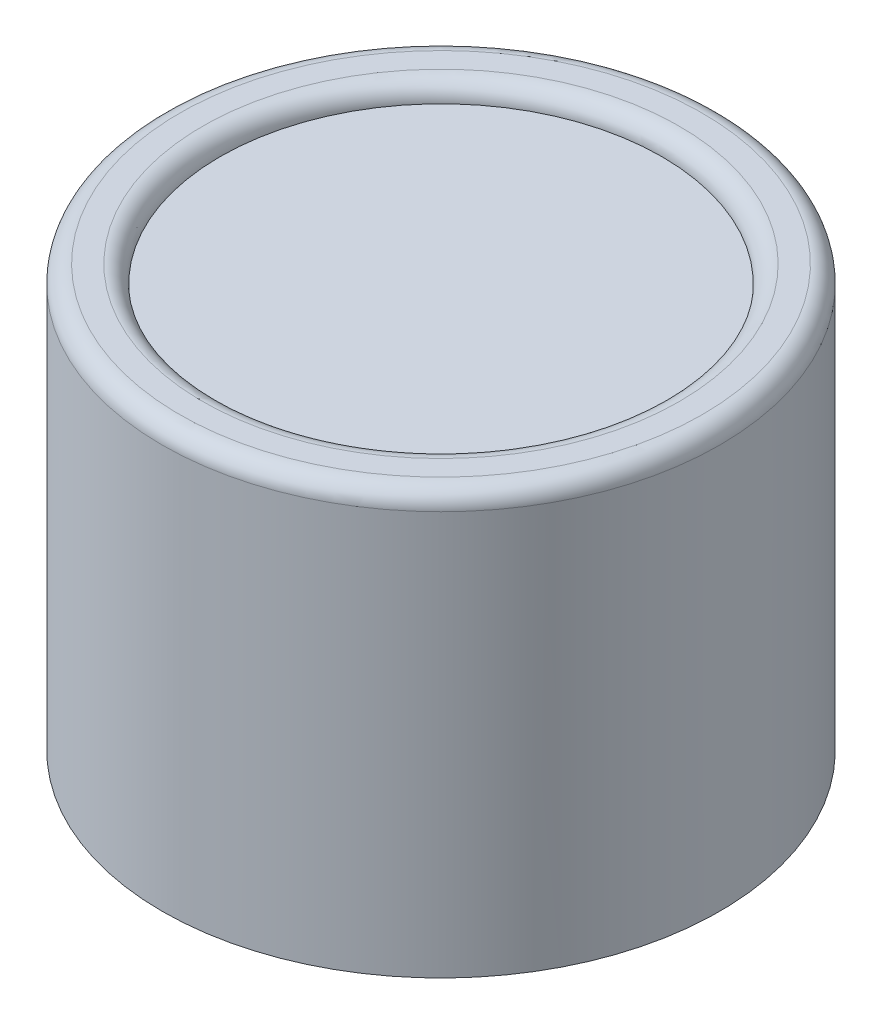
ISO-10303-21;
HEADER;
FILE_DESCRIPTION(('STEP AP214'),'2;1');
FILE_NAME('part.step','',(''),(''),'','','');
FILE_SCHEMA(('AUTOMOTIVE_DESIGN { 1 0 10303 214 1 1 1 1 }'));
ENDSEC;
DATA;
#1=APPLICATION_CONTEXT('core data for automotive mechanical design processes');
#2=APPLICATION_PROTOCOL_DEFINITION('international standard','automotive_design',2000,#1);
#3=PRODUCT_CONTEXT('',#1,'mechanical');
#4=PRODUCT('Part','Part','',(#3));
#5=PRODUCT_RELATED_PRODUCT_CATEGORY('part','',(#4));
#6=PRODUCT_DEFINITION_FORMATION('','',#4);
#7=PRODUCT_DEFINITION_CONTEXT('part definition',#1,'design');
#8=PRODUCT_DEFINITION('design','',#6,#7);
#9=PRODUCT_DEFINITION_SHAPE('','',#8);
#10=(LENGTH_UNIT() NAMED_UNIT(*) SI_UNIT(.MILLI.,.METRE.));
#11=(NAMED_UNIT(*) PLANE_ANGLE_UNIT() SI_UNIT($,.RADIAN.));
#12=(NAMED_UNIT(*) SI_UNIT($,.STERADIAN.) SOLID_ANGLE_UNIT());
#13=UNCERTAINTY_MEASURE_WITH_UNIT(LENGTH_MEASURE(1.E-05),#10,'distance_accuracy_value','');
#14=(GEOMETRIC_REPRESENTATION_CONTEXT(3) GLOBAL_UNCERTAINTY_ASSIGNED_CONTEXT((#13)) GLOBAL_UNIT_ASSIGNED_CONTEXT((#10,
#11,#12)) REPRESENTATION_CONTEXT('',''));
#15=CARTESIAN_POINT('',(0.,0.,0.));
#16=DIRECTION('',(0.,0.,1.));
#17=DIRECTION('',(1.,0.,0.));
#18=AXIS2_PLACEMENT_3D('',#15,#16,#17);
#19=CARTESIAN_POINT('',(-162.96132,0.,-162.96132));
#20=DIRECTION('',(0.,1.,0.));
#21=DIRECTION('',(0.,0.,1.));
#22=AXIS2_PLACEMENT_3D('',#19,#20,#21);
#23=PLANE('',#22);
#24=CARTESIAN_POINT('',(0.,0.,0.));
#25=DIRECTION('',(0.,-1.,0.));
#26=DIRECTION('',(1.,0.,0.));
#27=AXIS2_PLACEMENT_3D('',#24,#25,#26);
#28=CIRCLE('',#27,159.766);
#29=CARTESIAN_POINT('',(159.766,0.,0.));
#30=VERTEX_POINT('',#29);
#31=EDGE_CURVE('E19',#30,#30,#28,.T.);
#32=ORIENTED_EDGE('',*,*,#31,.F.);
#33=EDGE_LOOP('',(#32));
#34=FACE_BOUND('',#33,.T.);
#35=ADVANCED_FACE('F15',(#34),#23,.T.);
#36=CARTESIAN_POINT('',(0.,0.,0.));
#37=DIRECTION('',(0.,-1.,0.));
#38=DIRECTION('',(1.,0.,0.));
#39=AXIS2_PLACEMENT_3D('',#36,#37,#38);
#40=TOROIDAL_SURFACE('',#39,172.466,12.7);
#41=ORIENTED_EDGE('',*,*,#31,.T.);
#42=EDGE_LOOP('',(#41));
#43=FACE_BOUND('',#42,.T.);
#44=CARTESIAN_POINT('',(0.,12.7,0.));
#45=DIRECTION('',(0.,-1.,0.));
#46=DIRECTION('',(1.,0.,0.));
#47=AXIS2_PLACEMENT_3D('',#44,#45,#46);
#48=CIRCLE('',#47,172.466);
#49=CARTESIAN_POINT('',(172.466,12.7,0.));
#50=VERTEX_POINT('',#49);
#51=EDGE_CURVE('E32',#50,#50,#48,.T.);
#52=ORIENTED_EDGE('',*,*,#51,.F.);
#53=EDGE_LOOP('',(#52));
#54=FACE_BOUND('',#53,.T.);
#55=ADVANCED_FACE('F39',(#43,#54),#40,.T.);
#56=CARTESIAN_POINT('',(-192.75552,12.7,-192.75552));
#57=DIRECTION('',(0.,1.,0.));
#58=DIRECTION('',(0.,0.,1.));
#59=AXIS2_PLACEMENT_3D('',#56,#57,#58);
#60=PLANE('',#59);
#61=ORIENTED_EDGE('',*,*,#51,.T.);
#62=EDGE_LOOP('',(#61));
#63=FACE_BOUND('',#62,.T.);
#64=CARTESIAN_POINT('',(0.,12.7,0.));
#65=DIRECTION('',(0.,-1.,0.));
#66=DIRECTION('',(1.,0.,0.));
#67=AXIS2_PLACEMENT_3D('',#64,#65,#66);
#68=CIRCLE('',#67,188.976);
#69=CARTESIAN_POINT('',(188.976,12.7,0.));
#70=VERTEX_POINT('',#69);
#71=EDGE_CURVE('E28',#70,#70,#68,.T.);
#72=ORIENTED_EDGE('',*,*,#71,.F.);
#73=EDGE_LOOP('',(#72));
#74=FACE_BOUND('',#73,.T.);
#75=ADVANCED_FACE('F48',(#63,#74),#60,.T.);
#76=CARTESIAN_POINT('',(205.70952,-292.1,-205.70952));
#77=DIRECTION('',(0.,-1.,0.));
#78=DIRECTION('',(0.,0.,-1.));
#79=AXIS2_PLACEMENT_3D('',#76,#77,#78);
#80=PLANE('',#79);
#81=CARTESIAN_POINT('',(0.,-292.1,0.));
#82=DIRECTION('',(0.,1.,0.));
#83=DIRECTION('',(0.,0.,1.));
#84=AXIS2_PLACEMENT_3D('',#81,#82,#83);
#85=CIRCLE('',#84,201.676);
#86=CARTESIAN_POINT('',(0.,-292.1,201.676));
#87=VERTEX_POINT('',#86);
#88=EDGE_CURVE('E23',#87,#87,#85,.T.);
#89=ORIENTED_EDGE('',*,*,#88,.F.);
#90=EDGE_LOOP('',(#89));
#91=FACE_BOUND('',#90,.T.);
#92=ADVANCED_FACE('F56',(#91),#80,.T.);
#93=CARTESIAN_POINT('',(0.,0.,0.));
#94=DIRECTION('',(0.,-1.,0.));
#95=DIRECTION('',(1.,0.,0.));
#96=AXIS2_PLACEMENT_3D('',#93,#94,#95);
#97=TOROIDAL_SURFACE('',#96,188.976,12.7);
#98=CARTESIAN_POINT('',(0.,0.,0.));
#99=DIRECTION('',(0.,-1.,0.));
#100=DIRECTION('',(1.,0.,0.));
#101=AXIS2_PLACEMENT_3D('',#98,#99,#100);
#102=CIRCLE('',#101,201.676);
#103=CARTESIAN_POINT('',(201.676,0.,0.));
#104=VERTEX_POINT('',#103);
#105=EDGE_CURVE('E10',#104,#104,#102,.T.);
#106=ORIENTED_EDGE('',*,*,#105,.F.);
#107=EDGE_LOOP('',(#106));
#108=FACE_BOUND('',#107,.T.);
#109=ORIENTED_EDGE('',*,*,#71,.T.);
#110=EDGE_LOOP('',(#109));
#111=FACE_BOUND('',#110,.T.);
#112=ADVANCED_FACE('F52',(#108,#111),#97,.T.);
#113=CARTESIAN_POINT('',(0.,-292.1,0.));
#114=DIRECTION('',(0.,1.,0.));
#115=DIRECTION('',(0.,0.,1.));
#116=AXIS2_PLACEMENT_3D('',#113,#114,#115);
#117=CYLINDRICAL_SURFACE('',#116,201.676);
#118=ORIENTED_EDGE('',*,*,#105,.T.);
#119=EDGE_LOOP('',(#118));
#120=FACE_BOUND('',#119,.T.);
#121=ORIENTED_EDGE('',*,*,#88,.T.);
#122=EDGE_LOOP('',(#121));
#123=FACE_BOUND('',#122,.T.);
#124=ADVANCED_FACE('F17',(#120,#123),#117,.T.);
#125=CLOSED_SHELL('',(#35,#55,#75,#92,#112,#124));
#126=MANIFOLD_SOLID_BREP('B1',#125);
#127=ADVANCED_BREP_SHAPE_REPRESENTATION('',(#18,#126),#14);
#128=SHAPE_DEFINITION_REPRESENTATION(#9,#127);
ENDSEC;
END-ISO-10303-21;
